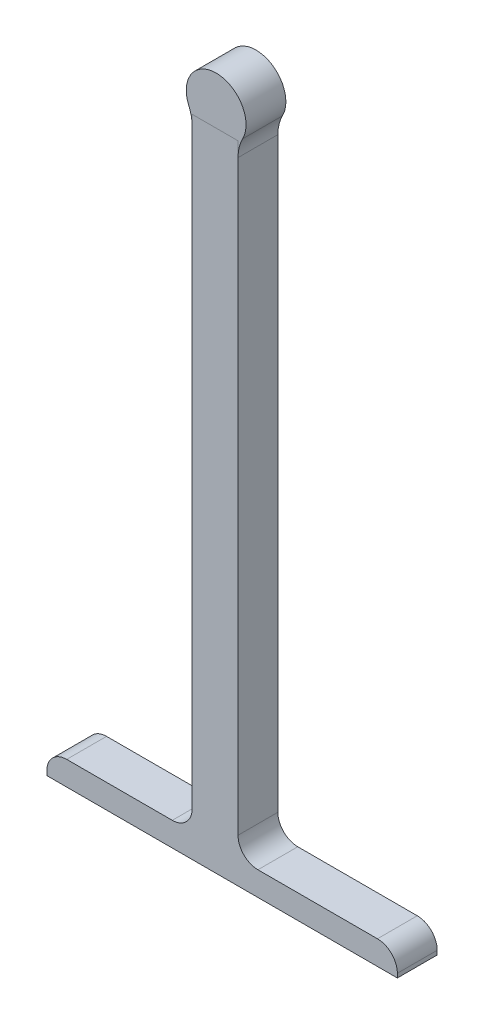
ISO-10303-21;
HEADER;
FILE_DESCRIPTION(('STEP AP214'),'2;1');
FILE_NAME('part.step','',(''),(''),'','','');
FILE_SCHEMA(('AUTOMOTIVE_DESIGN { 1 0 10303 214 1 1 1 1 }'));
ENDSEC;
DATA;
#1=APPLICATION_CONTEXT('core data for automotive mechanical design processes');
#2=APPLICATION_PROTOCOL_DEFINITION('international standard','automotive_design',2000,#1);
#3=PRODUCT_CONTEXT('',#1,'mechanical');
#4=PRODUCT('Part','Part','',(#3));
#5=PRODUCT_RELATED_PRODUCT_CATEGORY('part','',(#4));
#6=PRODUCT_DEFINITION_FORMATION('','',#4);
#7=PRODUCT_DEFINITION_CONTEXT('part definition',#1,'design');
#8=PRODUCT_DEFINITION('design','',#6,#7);
#9=PRODUCT_DEFINITION_SHAPE('','',#8);
#10=(LENGTH_UNIT() NAMED_UNIT(*) SI_UNIT(.MILLI.,.METRE.));
#11=(NAMED_UNIT(*) PLANE_ANGLE_UNIT() SI_UNIT($,.RADIAN.));
#12=(NAMED_UNIT(*) SI_UNIT($,.STERADIAN.) SOLID_ANGLE_UNIT());
#13=UNCERTAINTY_MEASURE_WITH_UNIT(LENGTH_MEASURE(1.E-05),#10,'distance_accuracy_value','');
#14=(GEOMETRIC_REPRESENTATION_CONTEXT(3) GLOBAL_UNCERTAINTY_ASSIGNED_CONTEXT((#13)) GLOBAL_UNIT_ASSIGNED_CONTEXT((#10,
#11,#12)) REPRESENTATION_CONTEXT('',''));
#15=CARTESIAN_POINT('',(0.,0.,0.));
#16=DIRECTION('',(0.,0.,1.));
#17=DIRECTION('',(1.,0.,0.));
#18=AXIS2_PLACEMENT_3D('',#15,#16,#17);
#19=CARTESIAN_POINT('',(0.,0.,10.));
#20=DIRECTION('',(0.,0.,-1.));
#21=DIRECTION('',(-1.,0.,0.));
#22=AXIS2_PLACEMENT_3D('',#19,#20,#21);
#23=CYLINDRICAL_SURFACE('',#22,7.5);
#24=CARTESIAN_POINT('',(0.,0.,0.));
#25=DIRECTION('',(0.,0.,1.));
#26=DIRECTION('',(1.,0.,0.));
#27=AXIS2_PLACEMENT_3D('',#24,#25,#26);
#28=CIRCLE('',#27,7.5);
#29=CARTESIAN_POINT('',(6.63779842775113,-3.49136535363239,0.));
#30=VERTEX_POINT('',#29);
#31=CARTESIAN_POINT('',(-6.86220157224887,-3.02658050972135,0.));
#32=VERTEX_POINT('',#31);
#33=EDGE_CURVE('E234',#30,#32,#28,.T.);
#34=ORIENTED_EDGE('',*,*,#33,.T.);
#35=DIRECTION('',(0.,0.,-1.));
#36=VECTOR('',#35,1.);
#37=CARTESIAN_POINT('',(-6.86220157224887,-3.02658050972135,10.));
#38=LINE('',#37,#36);
#39=CARTESIAN_POINT('',(-6.86220157224887,-3.02658050972135,10.));
#40=VERTEX_POINT('',#39);
#41=EDGE_CURVE('E257',#32,#40,#38,.F.);
#42=ORIENTED_EDGE('',*,*,#41,.T.);
#43=CARTESIAN_POINT('',(0.,0.,10.));
#44=DIRECTION('',(0.,0.,1.));
#45=DIRECTION('',(1.,0.,0.));
#46=AXIS2_PLACEMENT_3D('',#43,#44,#45);
#47=CIRCLE('',#46,7.5);
#48=CARTESIAN_POINT('',(6.63779842775113,-3.49136535363239,10.));
#49=VERTEX_POINT('',#48);
#50=EDGE_CURVE('E235',#49,#40,#47,.T.);
#51=ORIENTED_EDGE('',*,*,#50,.F.);
#52=DIRECTION('',(0.,0.,-1.));
#53=VECTOR('',#52,1.);
#54=CARTESIAN_POINT('',(6.63779842775113,-3.49136535363239,10.));
#55=LINE('',#54,#53);
#56=EDGE_CURVE('E239',#49,#30,#55,.T.);
#57=ORIENTED_EDGE('',*,*,#56,.T.);
#58=EDGE_LOOP('',(#34,#42,#51,#57));
#59=FACE_BOUND('',#58,.T.);
#60=ADVANCED_FACE('F39',(#59),#23,.T.);
#61=CARTESIAN_POINT('',(0.,0.,10.));
#62=DIRECTION('',(0.,0.,1.));
#63=DIRECTION('',(1.,0.,0.));
#64=AXIS2_PLACEMENT_3D('',#61,#62,#63);
#65=PLANE('',#64);
#66=DIRECTION('',(-1.,0.,0.));
#67=VECTOR('',#66,1.);
#68=CARTESIAN_POINT('',(0.,-4.48421862206111,10.));
#69=LINE('',#68,#67);
#70=CARTESIAN_POINT('',(5.4881963314193,-4.48421862206111,10.));
#71=VERTEX_POINT('',#70);
#72=CARTESIAN_POINT('',(-6.0118036685807,-4.48421862206111,10.));
#73=VERTEX_POINT('',#72);
#74=EDGE_CURVE('E230',#71,#73,#69,.T.);
#75=ORIENTED_EDGE('',*,*,#74,.F.);
#76=DIRECTION('',(0.,1.,0.));
#77=VECTOR('',#76,1.);
#78=CARTESIAN_POINT('',(5.4881963314193,0.,10.));
#79=LINE('',#78,#77);
#80=CARTESIAN_POINT('',(5.4881963314193,-8.14651915847558,10.));
#81=VERTEX_POINT('',#80);
#82=EDGE_CURVE('E223',#81,#71,#79,.T.);
#83=ORIENTED_EDGE('',*,*,#82,.F.);
#84=CARTESIAN_POINT('',(15.4881963314193,-8.14651915847558,10.));
#85=DIRECTION('',(0.,0.,1.));
#86=DIRECTION('',(1.,0.,0.));
#87=AXIS2_PLACEMENT_3D('',#84,#85,#86);
#88=CIRCLE('',#87,10.);
#89=EDGE_CURVE('E254',#81,#49,#88,.F.);
#90=ORIENTED_EDGE('',*,*,#89,.T.);
#91=ORIENTED_EDGE('',*,*,#50,.T.);
#92=CARTESIAN_POINT('',(-16.0118036685807,-7.06202118934982,10.));
#93=DIRECTION('',(0.,0.,1.));
#94=DIRECTION('',(1.,0.,0.));
#95=AXIS2_PLACEMENT_3D('',#92,#93,#94);
#96=CIRCLE('',#95,10.);
#97=CARTESIAN_POINT('',(-6.0118036685807,-7.06202118934982,10.));
#98=VERTEX_POINT('',#97);
#99=EDGE_CURVE('E268',#40,#98,#96,.F.);
#100=ORIENTED_EDGE('',*,*,#99,.T.);
#101=DIRECTION('',(0.,-1.,0.));
#102=VECTOR('',#101,1.);
#103=CARTESIAN_POINT('',(-6.0118036685807,0.,10.));
#104=LINE('',#103,#102);
#105=EDGE_CURVE('E264',#73,#98,#104,.T.);
#106=ORIENTED_EDGE('',*,*,#105,.F.);
#107=EDGE_LOOP('',(#75,#83,#90,#91,#100,#106));
#108=FACE_BOUND('',#107,.T.);
#109=ADVANCED_FACE('F335',(#108),#65,.T.);
#110=CARTESIAN_POINT('',(0.,0.,0.));
#111=DIRECTION('',(0.,0.,1.));
#112=DIRECTION('',(1.,0.,0.));
#113=AXIS2_PLACEMENT_3D('',#110,#111,#112);
#114=PLANE('',#113);
#115=DIRECTION('',(1.,0.,0.));
#116=VECTOR('',#115,1.);
#117=CARTESIAN_POINT('',(-42.5118036685807,-160.454509947997,0.));
#118=LINE('',#117,#116);
#119=CARTESIAN_POINT('',(10.4881963314193,-160.454509947997,0.));
#120=VERTEX_POINT('',#119);
#121=CARTESIAN_POINT('',(40.4881963314193,-160.454509947997,0.));
#122=VERTEX_POINT('',#121);
#123=EDGE_CURVE('E193',#120,#122,#118,.T.);
#124=ORIENTED_EDGE('',*,*,#123,.T.);
#125=CARTESIAN_POINT('',(40.4881963314193,-165.454509947997,0.));
#126=DIRECTION('',(0.,0.,1.));
#127=DIRECTION('',(1.,0.,0.));
#128=AXIS2_PLACEMENT_3D('',#125,#126,#127);
#129=CIRCLE('',#128,5.);
#130=CARTESIAN_POINT('',(45.4881963314193,-165.454509947997,0.));
#131=VERTEX_POINT('',#130);
#132=EDGE_CURVE('E11',#122,#131,#129,.F.);
#133=ORIENTED_EDGE('',*,*,#132,.T.);
#134=DIRECTION('',(0.,1.,0.));
#135=VECTOR('',#134,1.);
#136=CARTESIAN_POINT('',(45.4881963314193,-166.484218622061,0.));
#137=LINE('',#136,#135);
#138=CARTESIAN_POINT('',(45.4881963314193,-166.484218622061,0.));
#139=VERTEX_POINT('',#138);
#140=EDGE_CURVE('E179',#139,#131,#137,.T.);
#141=ORIENTED_EDGE('',*,*,#140,.F.);
#142=DIRECTION('',(1.,0.,0.));
#143=VECTOR('',#142,1.);
#144=CARTESIAN_POINT('',(-6.01180366858068,-166.484218622061,0.));
#145=LINE('',#144,#143);
#146=CARTESIAN_POINT('',(-42.5118036685807,-166.484218622061,0.));
#147=VERTEX_POINT('',#146);
#148=EDGE_CURVE('E177',#147,#139,#145,.T.);
#149=ORIENTED_EDGE('',*,*,#148,.F.);
#150=DIRECTION('',(0.,1.,0.));
#151=VECTOR('',#150,1.);
#152=CARTESIAN_POINT('',(-42.5118036685807,-166.484218622061,0.));
#153=LINE('',#152,#151);
#154=CARTESIAN_POINT('',(-42.5118036685807,-165.454509947997,0.));
#155=VERTEX_POINT('',#154);
#156=EDGE_CURVE('E189',#147,#155,#153,.T.);
#157=ORIENTED_EDGE('',*,*,#156,.T.);
#158=CARTESIAN_POINT('',(-37.5118036685807,-165.454509947997,0.));
#159=DIRECTION('',(0.,0.,1.));
#160=DIRECTION('',(1.,0.,0.));
#161=AXIS2_PLACEMENT_3D('',#158,#159,#160);
#162=CIRCLE('',#161,5.);
#163=CARTESIAN_POINT('',(-37.5118036685807,-160.454509947997,0.));
#164=VERTEX_POINT('',#163);
#165=EDGE_CURVE('E311',#155,#164,#162,.F.);
#166=ORIENTED_EDGE('',*,*,#165,.T.);
#167=CARTESIAN_POINT('',(-11.0118036685807,-160.454509947997,0.));
#168=VERTEX_POINT('',#167);
#169=EDGE_CURVE('E198',#164,#168,#118,.T.);
#170=ORIENTED_EDGE('',*,*,#169,.T.);
#171=CARTESIAN_POINT('',(-11.0118036685807,-155.454509947997,0.));
#172=DIRECTION('',(0.,0.,1.));
#173=DIRECTION('',(1.,0.,0.));
#174=AXIS2_PLACEMENT_3D('',#171,#172,#173);
#175=CIRCLE('',#174,5.);
#176=CARTESIAN_POINT('',(-6.01180366858068,-155.454509947997,0.));
#177=VERTEX_POINT('',#176);
#178=EDGE_CURVE('E294',#168,#177,#175,.T.);
#179=ORIENTED_EDGE('',*,*,#178,.T.);
#180=DIRECTION('',(0.,-1.,0.));
#181=VECTOR('',#180,1.);
#182=CARTESIAN_POINT('',(-6.0118036685807,-4.48421862206111,0.));
#183=LINE('',#182,#181);
#184=CARTESIAN_POINT('',(-6.0118036685807,-7.06202118934982,0.));
#185=VERTEX_POINT('',#184);
#186=EDGE_CURVE('E210',#185,#177,#183,.T.);
#187=ORIENTED_EDGE('',*,*,#186,.F.);
#188=CARTESIAN_POINT('',(-16.0118036685807,-7.06202118934982,0.));
#189=DIRECTION('',(0.,0.,1.));
#190=DIRECTION('',(1.,0.,0.));
#191=AXIS2_PLACEMENT_3D('',#188,#189,#190);
#192=CIRCLE('',#191,10.);
#193=EDGE_CURVE('E271',#185,#32,#192,.T.);
#194=ORIENTED_EDGE('',*,*,#193,.T.);
#195=ORIENTED_EDGE('',*,*,#33,.F.);
#196=CARTESIAN_POINT('',(15.4881963314193,-8.14651915847558,0.));
#197=DIRECTION('',(0.,0.,1.));
#198=DIRECTION('',(1.,0.,0.));
#199=AXIS2_PLACEMENT_3D('',#196,#197,#198);
#200=CIRCLE('',#199,10.);
#201=CARTESIAN_POINT('',(5.4881963314193,-8.14651915847558,0.));
#202=VERTEX_POINT('',#201);
#203=EDGE_CURVE('E250',#30,#202,#200,.T.);
#204=ORIENTED_EDGE('',*,*,#203,.T.);
#205=DIRECTION('',(0.,1.,0.));
#206=VECTOR('',#205,1.);
#207=CARTESIAN_POINT('',(5.4881963314193,-4.48421862206111,0.));
#208=LINE('',#207,#206);
#209=CARTESIAN_POINT('',(5.48819633141932,-155.454509947997,0.));
#210=VERTEX_POINT('',#209);
#211=EDGE_CURVE('E216',#210,#202,#208,.T.);
#212=ORIENTED_EDGE('',*,*,#211,.F.);
#213=CARTESIAN_POINT('',(10.4881963314193,-155.454509947997,0.));
#214=DIRECTION('',(0.,0.,1.));
#215=DIRECTION('',(1.,0.,0.));
#216=AXIS2_PLACEMENT_3D('',#213,#214,#215);
#217=CIRCLE('',#216,5.);
#218=EDGE_CURVE('E284',#210,#120,#217,.T.);
#219=ORIENTED_EDGE('',*,*,#218,.T.);
#220=EDGE_LOOP('',(#124,#133,#141,#149,#157,#166,#170,#179,#187,#194,#195,#204,#212,#219));
#221=FACE_BOUND('',#220,.T.);
#222=ADVANCED_FACE('F322',(#221),#114,.F.);
#223=CARTESIAN_POINT('',(5.4881963314193,-4.48421862206111,0.));
#224=DIRECTION('',(1.,0.,0.));
#225=DIRECTION('',(0.,1.,0.));
#226=AXIS2_PLACEMENT_3D('',#223,#224,#225);
#227=PLANE('',#226);
#228=DIRECTION('',(0.,1.,0.));
#229=VECTOR('',#228,1.);
#230=CARTESIAN_POINT('',(5.4881963314193,-4.48421862206111,10.001));
#231=LINE('',#230,#229);
#232=CARTESIAN_POINT('',(5.48819633141932,-155.454509947997,10.001));
#233=VERTEX_POINT('',#232);
#234=CARTESIAN_POINT('',(5.4881963314193,-4.48421862206111,10.001));
#235=VERTEX_POINT('',#234);
#236=EDGE_CURVE('E173',#233,#235,#231,.T.);
#237=ORIENTED_EDGE('',*,*,#236,.F.);
#238=DIRECTION('',(0.,0.,1.));
#239=VECTOR('',#238,1.);
#240=CARTESIAN_POINT('',(5.48819633141932,-155.454509947997,0.));
#241=LINE('',#240,#239);
#242=EDGE_CURVE('E278',#233,#210,#241,.F.);
#243=ORIENTED_EDGE('',*,*,#242,.T.);
#244=ORIENTED_EDGE('',*,*,#211,.T.);
#245=DIRECTION('',(0.,0.,-1.));
#246=VECTOR('',#245,1.);
#247=CARTESIAN_POINT('',(5.4881963314193,-8.14651915847558,0.));
#248=LINE('',#247,#246);
#249=EDGE_CURVE('E246',#202,#81,#248,.F.);
#250=ORIENTED_EDGE('',*,*,#249,.T.);
#251=ORIENTED_EDGE('',*,*,#82,.T.);
#252=DIRECTION('',(0.,0.,1.));
#253=VECTOR('',#252,1.);
#254=CARTESIAN_POINT('',(5.4881963314193,-4.48421862206111,0.));
#255=LINE('',#254,#253);
#256=EDGE_CURVE('E219',#71,#235,#255,.T.);
#257=ORIENTED_EDGE('',*,*,#256,.T.);
#258=EDGE_LOOP('',(#237,#243,#244,#250,#251,#257));
#259=FACE_BOUND('',#258,.T.);
#260=ADVANCED_FACE('F384',(#259),#227,.T.);
#261=CARTESIAN_POINT('',(-6.0118036685807,-4.48421862206111,0.));
#262=DIRECTION('',(-1.,0.,0.));
#263=DIRECTION('',(0.,-1.,0.));
#264=AXIS2_PLACEMENT_3D('',#261,#262,#263);
#265=PLANE('',#264);
#266=ORIENTED_EDGE('',*,*,#186,.T.);
#267=DIRECTION('',(0.,0.,-1.));
#268=VECTOR('',#267,1.);
#269=CARTESIAN_POINT('',(-6.01180366858068,-155.454509947997,10.001));
#270=LINE('',#269,#268);
#271=CARTESIAN_POINT('',(-6.01180366858068,-155.454509947997,10.001));
#272=VERTEX_POINT('',#271);
#273=EDGE_CURVE('E291',#177,#272,#270,.F.);
#274=ORIENTED_EDGE('',*,*,#273,.T.);
#275=DIRECTION('',(0.,-1.,0.));
#276=VECTOR('',#275,1.);
#277=CARTESIAN_POINT('',(-6.0118036685807,-4.48421862206111,10.001));
#278=LINE('',#277,#276);
#279=CARTESIAN_POINT('',(-6.0118036685807,-4.48421862206111,10.001));
#280=VERTEX_POINT('',#279);
#281=EDGE_CURVE('E174',#280,#272,#278,.T.);
#282=ORIENTED_EDGE('',*,*,#281,.F.);
#283=DIRECTION('',(0.,0.,1.));
#284=VECTOR('',#283,1.);
#285=CARTESIAN_POINT('',(-6.0118036685807,-4.48421862206111,0.));
#286=LINE('',#285,#284);
#287=EDGE_CURVE('E220',#73,#280,#286,.T.);
#288=ORIENTED_EDGE('',*,*,#287,.F.);
#289=ORIENTED_EDGE('',*,*,#105,.T.);
#290=DIRECTION('',(0.,0.,-1.));
#291=VECTOR('',#290,1.);
#292=CARTESIAN_POINT('',(-6.0118036685807,-7.06202118934982,0.));
#293=LINE('',#292,#291);
#294=EDGE_CURVE('E261',#98,#185,#293,.T.);
#295=ORIENTED_EDGE('',*,*,#294,.T.);
#296=EDGE_LOOP('',(#266,#274,#282,#288,#289,#295));
#297=FACE_BOUND('',#296,.T.);
#298=ADVANCED_FACE('F370',(#297),#265,.T.);
#299=CARTESIAN_POINT('',(-6.0118036685807,-4.48421862206111,0.));
#300=DIRECTION('',(0.,1.,0.));
#301=DIRECTION('',(0.,0.,1.));
#302=AXIS2_PLACEMENT_3D('',#299,#300,#301);
#303=PLANE('',#302);
#304=ORIENTED_EDGE('',*,*,#256,.F.);
#305=ORIENTED_EDGE('',*,*,#74,.T.);
#306=ORIENTED_EDGE('',*,*,#287,.T.);
#307=DIRECTION('',(-1.,0.,0.));
#308=VECTOR('',#307,1.);
#309=CARTESIAN_POINT('',(-6.0118036685807,-4.48421862206111,10.001));
#310=LINE('',#309,#308);
#311=EDGE_CURVE('E206',#235,#280,#310,.T.);
#312=ORIENTED_EDGE('',*,*,#311,.F.);
#313=EDGE_LOOP('',(#304,#305,#306,#312));
#314=FACE_BOUND('',#313,.T.);
#315=ADVANCED_FACE('F387',(#314),#303,.T.);
#316=CARTESIAN_POINT('',(-6.01180366858068,-166.484218622061,0.));
#317=DIRECTION('',(0.,-1.,0.));
#318=DIRECTION('',(0.,0.,-1.));
#319=AXIS2_PLACEMENT_3D('',#316,#317,#318);
#320=PLANE('',#319);
#321=ORIENTED_EDGE('',*,*,#148,.T.);
#322=DIRECTION('',(0.,0.,-1.));
#323=VECTOR('',#322,1.);
#324=CARTESIAN_POINT('',(45.4881963314193,-166.484218622061,10.001));
#325=LINE('',#324,#323);
#326=CARTESIAN_POINT('',(45.4881963314193,-166.484218622061,10.001));
#327=VERTEX_POINT('',#326);
#328=EDGE_CURVE('E158',#327,#139,#325,.T.);
#329=ORIENTED_EDGE('',*,*,#328,.F.);
#330=DIRECTION('',(1.,0.,0.));
#331=VECTOR('',#330,1.);
#332=CARTESIAN_POINT('',(-6.01180366858068,-166.484218622061,10.001));
#333=LINE('',#332,#331);
#334=CARTESIAN_POINT('',(-42.5118036685807,-166.484218622061,10.001));
#335=VERTEX_POINT('',#334);
#336=EDGE_CURVE('E165',#335,#327,#333,.T.);
#337=ORIENTED_EDGE('',*,*,#336,.F.);
#338=DIRECTION('',(0.,0.,-1.));
#339=VECTOR('',#338,1.);
#340=CARTESIAN_POINT('',(-42.5118036685807,-166.484218622061,10.001));
#341=LINE('',#340,#339);
#342=EDGE_CURVE('E186',#335,#147,#341,.T.);
#343=ORIENTED_EDGE('',*,*,#342,.T.);
#344=EDGE_LOOP('',(#321,#329,#337,#343));
#345=FACE_BOUND('',#344,.T.);
#346=ADVANCED_FACE('F176',(#345),#320,.T.);
#347=CARTESIAN_POINT('',(0.,0.,10.001));
#348=DIRECTION('',(0.,0.,1.));
#349=DIRECTION('',(1.,0.,0.));
#350=AXIS2_PLACEMENT_3D('',#347,#348,#349);
#351=PLANE('',#350);
#352=DIRECTION('',(0.,-1.,0.));
#353=VECTOR('',#352,1.);
#354=CARTESIAN_POINT('',(45.4881963314193,-166.484218622061,10.001));
#355=LINE('',#354,#353);
#356=CARTESIAN_POINT('',(45.4881963314193,-165.454509947997,10.001));
#357=VERTEX_POINT('',#356);
#358=EDGE_CURVE('E153',#357,#327,#355,.T.);
#359=ORIENTED_EDGE('',*,*,#358,.F.);
#360=CARTESIAN_POINT('',(40.4881963314193,-165.454509947997,10.001));
#361=DIRECTION('',(0.,0.,1.));
#362=DIRECTION('',(1.,0.,0.));
#363=AXIS2_PLACEMENT_3D('',#360,#361,#362);
#364=CIRCLE('',#363,5.);
#365=CARTESIAN_POINT('',(40.4881963314193,-160.454509947997,10.001));
#366=VERTEX_POINT('',#365);
#367=EDGE_CURVE('E62',#357,#366,#364,.T.);
#368=ORIENTED_EDGE('',*,*,#367,.T.);
#369=DIRECTION('',(1.,0.,0.));
#370=VECTOR('',#369,1.);
#371=CARTESIAN_POINT('',(-42.5118036685807,-160.454509947997,10.001));
#372=LINE('',#371,#370);
#373=CARTESIAN_POINT('',(10.4881963314193,-160.454509947997,10.001));
#374=VERTEX_POINT('',#373);
#375=EDGE_CURVE('E197',#374,#366,#372,.T.);
#376=ORIENTED_EDGE('',*,*,#375,.F.);
#377=CARTESIAN_POINT('',(10.4881963314193,-155.454509947997,10.001));
#378=DIRECTION('',(0.,0.,1.));
#379=DIRECTION('',(1.,0.,0.));
#380=AXIS2_PLACEMENT_3D('',#377,#378,#379);
#381=CIRCLE('',#380,5.);
#382=EDGE_CURVE('E281',#374,#233,#381,.F.);
#383=ORIENTED_EDGE('',*,*,#382,.T.);
#384=ORIENTED_EDGE('',*,*,#236,.T.);
#385=ORIENTED_EDGE('',*,*,#311,.T.);
#386=ORIENTED_EDGE('',*,*,#281,.T.);
#387=CARTESIAN_POINT('',(-11.0118036685807,-155.454509947997,10.001));
#388=DIRECTION('',(0.,0.,1.));
#389=DIRECTION('',(1.,0.,0.));
#390=AXIS2_PLACEMENT_3D('',#387,#388,#389);
#391=CIRCLE('',#390,5.);
#392=CARTESIAN_POINT('',(-11.0118036685807,-160.454509947997,10.001));
#393=VERTEX_POINT('',#392);
#394=EDGE_CURVE('E297',#272,#393,#391,.F.);
#395=ORIENTED_EDGE('',*,*,#394,.T.);
#396=CARTESIAN_POINT('',(-37.5118036685807,-160.454509947997,10.001));
#397=VERTEX_POINT('',#396);
#398=EDGE_CURVE('E194',#397,#393,#372,.T.);
#399=ORIENTED_EDGE('',*,*,#398,.F.);
#400=CARTESIAN_POINT('',(-37.5118036685807,-165.454509947997,10.001));
#401=DIRECTION('',(0.,0.,1.));
#402=DIRECTION('',(1.,0.,0.));
#403=AXIS2_PLACEMENT_3D('',#400,#401,#402);
#404=CIRCLE('',#403,5.);
#405=CARTESIAN_POINT('',(-42.5118036685807,-165.454509947997,10.001));
#406=VERTEX_POINT('',#405);
#407=EDGE_CURVE('E305',#397,#406,#404,.T.);
#408=ORIENTED_EDGE('',*,*,#407,.T.);
#409=DIRECTION('',(0.,-1.,0.));
#410=VECTOR('',#409,1.);
#411=CARTESIAN_POINT('',(-42.5118036685807,-166.484218622061,10.001));
#412=LINE('',#411,#410);
#413=EDGE_CURVE('E168',#406,#335,#412,.T.);
#414=ORIENTED_EDGE('',*,*,#413,.T.);
#415=ORIENTED_EDGE('',*,*,#336,.T.);
#416=EDGE_LOOP('',(#359,#368,#376,#383,#384,#385,#386,#395,#399,#408,#414,#415));
#417=FACE_BOUND('',#416,.T.);
#418=ADVANCED_FACE('F166',(#417),#351,.T.);
#419=CARTESIAN_POINT('',(-42.5118036685807,0.,0.));
#420=DIRECTION('',(-1.,0.,0.));
#421=DIRECTION('',(0.,-1.,0.));
#422=AXIS2_PLACEMENT_3D('',#419,#420,#421);
#423=PLANE('',#422);
#424=ORIENTED_EDGE('',*,*,#413,.F.);
#425=DIRECTION('',(0.,0.,1.));
#426=VECTOR('',#425,1.);
#427=CARTESIAN_POINT('',(-42.5118036685807,-165.454509947997,0.));
#428=LINE('',#427,#426);
#429=EDGE_CURVE('E308',#406,#155,#428,.F.);
#430=ORIENTED_EDGE('',*,*,#429,.T.);
#431=ORIENTED_EDGE('',*,*,#156,.F.);
#432=ORIENTED_EDGE('',*,*,#342,.F.);
#433=EDGE_LOOP('',(#424,#430,#431,#432));
#434=FACE_BOUND('',#433,.T.);
#435=ADVANCED_FACE('F450',(#434),#423,.T.);
#436=CARTESIAN_POINT('',(-42.5118036685807,-160.454509947997,10.001));
#437=DIRECTION('',(0.,1.,0.));
#438=DIRECTION('',(-1.,0.,0.));
#439=AXIS2_PLACEMENT_3D('',#436,#437,#438);
#440=PLANE('',#439);
#441=ORIENTED_EDGE('',*,*,#169,.F.);
#442=DIRECTION('',(0.,0.,1.));
#443=VECTOR('',#442,1.);
#444=CARTESIAN_POINT('',(-37.5118036685807,-160.454509947997,10.001));
#445=LINE('',#444,#443);
#446=EDGE_CURVE('E301',#164,#397,#445,.T.);
#447=ORIENTED_EDGE('',*,*,#446,.T.);
#448=ORIENTED_EDGE('',*,*,#398,.T.);
#449=DIRECTION('',(0.,0.,-1.));
#450=VECTOR('',#449,1.);
#451=CARTESIAN_POINT('',(-11.0118036685807,-160.454509947997,0.));
#452=LINE('',#451,#450);
#453=EDGE_CURVE('E287',#393,#168,#452,.T.);
#454=ORIENTED_EDGE('',*,*,#453,.T.);
#455=EDGE_LOOP('',(#441,#447,#448,#454));
#456=FACE_BOUND('',#455,.T.);
#457=ADVANCED_FACE('F455',(#456),#440,.T.);
#458=ORIENTED_EDGE('',*,*,#375,.T.);
#459=DIRECTION('',(0.,0.,1.));
#460=VECTOR('',#459,1.);
#461=CARTESIAN_POINT('',(40.4881963314193,-160.454509947997,0.));
#462=LINE('',#461,#460);
#463=EDGE_CURVE('E48',#366,#122,#462,.F.);
#464=ORIENTED_EDGE('',*,*,#463,.T.);
#465=ORIENTED_EDGE('',*,*,#123,.F.);
#466=DIRECTION('',(0.,0.,1.));
#467=VECTOR('',#466,1.);
#468=CARTESIAN_POINT('',(10.4881963314193,-160.454509947997,10.001));
#469=LINE('',#468,#467);
#470=EDGE_CURVE('E274',#120,#374,#469,.T.);
#471=ORIENTED_EDGE('',*,*,#470,.T.);
#472=EDGE_LOOP('',(#458,#464,#465,#471));
#473=FACE_BOUND('',#472,.T.);
#474=ADVANCED_FACE('F382',(#473),#440,.T.);
#475=CARTESIAN_POINT('',(45.4881963314193,0.,0.));
#476=DIRECTION('',(-1.,0.,0.));
#477=DIRECTION('',(0.,-1.,0.));
#478=AXIS2_PLACEMENT_3D('',#475,#476,#477);
#479=PLANE('',#478);
#480=ORIENTED_EDGE('',*,*,#140,.T.);
#481=DIRECTION('',(0.,0.,1.));
#482=VECTOR('',#481,1.);
#483=CARTESIAN_POINT('',(45.4881963314193,-165.454509947997,10.001));
#484=LINE('',#483,#482);
#485=EDGE_CURVE('E161',#131,#357,#484,.T.);
#486=ORIENTED_EDGE('',*,*,#485,.T.);
#487=ORIENTED_EDGE('',*,*,#358,.T.);
#488=ORIENTED_EDGE('',*,*,#328,.T.);
#489=EDGE_LOOP('',(#480,#486,#487,#488));
#490=FACE_BOUND('',#489,.T.);
#491=ADVANCED_FACE('F156',(#490),#479,.F.);
#492=CARTESIAN_POINT('',(15.4881963314193,-8.14651915847558,10.));
#493=DIRECTION('',(0.,0.,-1.));
#494=DIRECTION('',(-1.,0.,0.));
#495=AXIS2_PLACEMENT_3D('',#492,#493,#494);
#496=CYLINDRICAL_SURFACE('',#495,10.);
#497=ORIENTED_EDGE('',*,*,#89,.F.);
#498=ORIENTED_EDGE('',*,*,#249,.F.);
#499=ORIENTED_EDGE('',*,*,#203,.F.);
#500=ORIENTED_EDGE('',*,*,#56,.F.);
#501=EDGE_LOOP('',(#497,#498,#499,#500));
#502=FACE_BOUND('',#501,.T.);
#503=ADVANCED_FACE('F345',(#502),#496,.F.);
#504=CARTESIAN_POINT('',(-16.0118036685807,-7.06202118934982,10.));
#505=DIRECTION('',(0.,0.,-1.));
#506=DIRECTION('',(-1.,0.,0.));
#507=AXIS2_PLACEMENT_3D('',#504,#505,#506);
#508=CYLINDRICAL_SURFACE('',#507,10.);
#509=ORIENTED_EDGE('',*,*,#193,.F.);
#510=ORIENTED_EDGE('',*,*,#294,.F.);
#511=ORIENTED_EDGE('',*,*,#99,.F.);
#512=ORIENTED_EDGE('',*,*,#41,.F.);
#513=EDGE_LOOP('',(#509,#510,#511,#512));
#514=FACE_BOUND('',#513,.T.);
#515=ADVANCED_FACE('F348',(#514),#508,.F.);
#516=CARTESIAN_POINT('',(10.4881963314193,-155.454509947997,10.001));
#517=DIRECTION('',(0.,0.,-1.));
#518=DIRECTION('',(-1.,0.,0.));
#519=AXIS2_PLACEMENT_3D('',#516,#517,#518);
#520=CYLINDRICAL_SURFACE('',#519,5.);
#521=ORIENTED_EDGE('',*,*,#218,.F.);
#522=ORIENTED_EDGE('',*,*,#242,.F.);
#523=ORIENTED_EDGE('',*,*,#382,.F.);
#524=ORIENTED_EDGE('',*,*,#470,.F.);
#525=EDGE_LOOP('',(#521,#522,#523,#524));
#526=FACE_BOUND('',#525,.T.);
#527=ADVANCED_FACE('F352',(#526),#520,.F.);
#528=CARTESIAN_POINT('',(-11.0118036685807,-155.454509947997,10.001));
#529=DIRECTION('',(0.,0.,1.));
#530=DIRECTION('',(1.,0.,0.));
#531=AXIS2_PLACEMENT_3D('',#528,#529,#530);
#532=CYLINDRICAL_SURFACE('',#531,5.);
#533=ORIENTED_EDGE('',*,*,#394,.F.);
#534=ORIENTED_EDGE('',*,*,#273,.F.);
#535=ORIENTED_EDGE('',*,*,#178,.F.);
#536=ORIENTED_EDGE('',*,*,#453,.F.);
#537=EDGE_LOOP('',(#533,#534,#535,#536));
#538=FACE_BOUND('',#537,.T.);
#539=ADVANCED_FACE('F332',(#538),#532,.F.);
#540=CARTESIAN_POINT('',(-37.5118036685807,-165.454509947997,10.001));
#541=DIRECTION('',(0.,0.,1.));
#542=DIRECTION('',(1.,0.,0.));
#543=AXIS2_PLACEMENT_3D('',#540,#541,#542);
#544=CYLINDRICAL_SURFACE('',#543,5.);
#545=ORIENTED_EDGE('',*,*,#165,.F.);
#546=ORIENTED_EDGE('',*,*,#429,.F.);
#547=ORIENTED_EDGE('',*,*,#407,.F.);
#548=ORIENTED_EDGE('',*,*,#446,.F.);
#549=EDGE_LOOP('',(#545,#546,#547,#548));
#550=FACE_BOUND('',#549,.T.);
#551=ADVANCED_FACE('F328',(#550),#544,.T.);
#552=CARTESIAN_POINT('',(40.4881963314193,-165.454509947997,0.));
#553=DIRECTION('',(0.,0.,-1.));
#554=DIRECTION('',(-1.,0.,0.));
#555=AXIS2_PLACEMENT_3D('',#552,#553,#554);
#556=CYLINDRICAL_SURFACE('',#555,5.);
#557=ORIENTED_EDGE('',*,*,#132,.F.);
#558=ORIENTED_EDGE('',*,*,#463,.F.);
#559=ORIENTED_EDGE('',*,*,#367,.F.);
#560=ORIENTED_EDGE('',*,*,#485,.F.);
#561=EDGE_LOOP('',(#557,#558,#559,#560));
#562=FACE_BOUND('',#561,.T.);
#563=ADVANCED_FACE('F41',(#562),#556,.T.);
#564=CLOSED_SHELL('',(#60,#109,#222,#260,#298,#315,#346,#418,#435,#457,#474,#491,#503,#515,#527,
#539,#551,#563));
#565=MANIFOLD_SOLID_BREP('B2',#564);
#566=ADVANCED_BREP_SHAPE_REPRESENTATION('',(#18,#565),#14);
#567=SHAPE_DEFINITION_REPRESENTATION(#9,#566);
ENDSEC;
END-ISO-10303-21;
